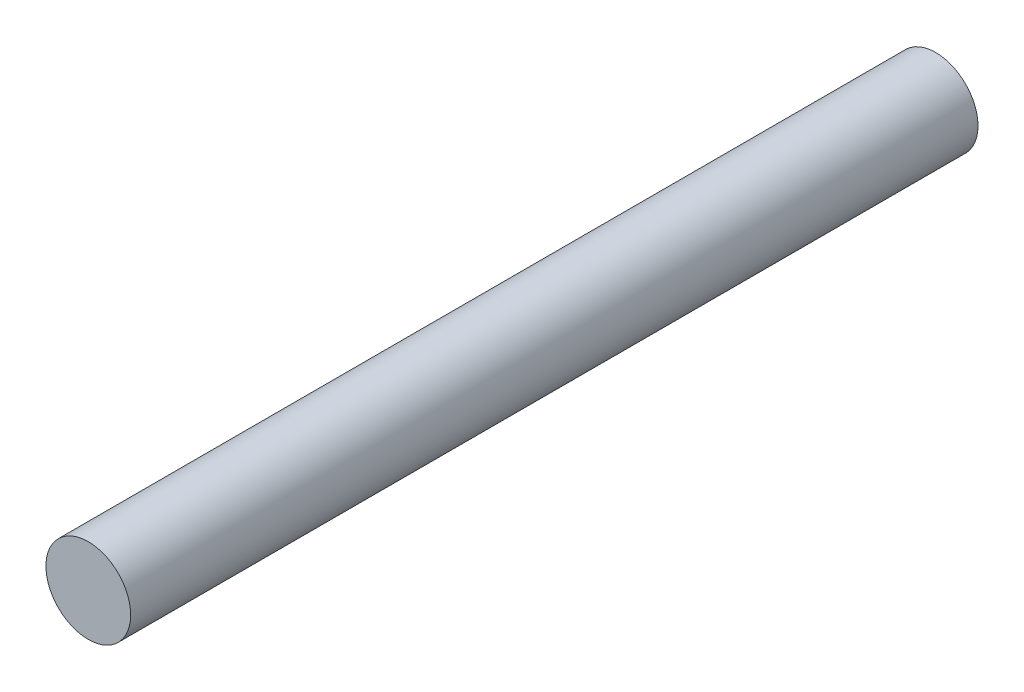
ISO-10303-21;
HEADER;
FILE_DESCRIPTION(('STEP AP214'),'2;1');
FILE_NAME('part.step','',(''),(''),'','','');
FILE_SCHEMA(('AUTOMOTIVE_DESIGN { 1 0 10303 214 1 1 1 1 }'));
ENDSEC;
DATA;
#1=APPLICATION_CONTEXT('core data for automotive mechanical design processes');
#2=APPLICATION_PROTOCOL_DEFINITION('international standard','automotive_design',2000,#1);
#3=PRODUCT_CONTEXT('',#1,'mechanical');
#4=PRODUCT('Part','Part','',(#3));
#5=PRODUCT_RELATED_PRODUCT_CATEGORY('part','',(#4));
#6=PRODUCT_DEFINITION_FORMATION('','',#4);
#7=PRODUCT_DEFINITION_CONTEXT('part definition',#1,'design');
#8=PRODUCT_DEFINITION('design','',#6,#7);
#9=PRODUCT_DEFINITION_SHAPE('','',#8);
#10=(LENGTH_UNIT() NAMED_UNIT(*) SI_UNIT(.MILLI.,.METRE.));
#11=(NAMED_UNIT(*) PLANE_ANGLE_UNIT() SI_UNIT($,.RADIAN.));
#12=(NAMED_UNIT(*) SI_UNIT($,.STERADIAN.) SOLID_ANGLE_UNIT());
#13=UNCERTAINTY_MEASURE_WITH_UNIT(LENGTH_MEASURE(1.E-05),#10,'distance_accuracy_value','');
#14=(GEOMETRIC_REPRESENTATION_CONTEXT(3) GLOBAL_UNCERTAINTY_ASSIGNED_CONTEXT((#13)) GLOBAL_UNIT_ASSIGNED_CONTEXT((#10,
#11,#12)) REPRESENTATION_CONTEXT('',''));
#15=CARTESIAN_POINT('',(0.,0.,0.));
#16=DIRECTION('',(0.,0.,1.));
#17=DIRECTION('',(1.,0.,0.));
#18=AXIS2_PLACEMENT_3D('',#15,#16,#17);
#19=CARTESIAN_POINT('',(0.,0.,30.));
#20=DIRECTION('',(0.,0.,-1.));
#21=DIRECTION('',(-1.,0.,0.));
#22=AXIS2_PLACEMENT_3D('',#19,#20,#21);
#23=CYLINDRICAL_SURFACE('',#22,1.5);
#24=CARTESIAN_POINT('',(0.,0.,30.));
#25=DIRECTION('',(0.,0.,1.));
#26=DIRECTION('',(1.,0.,0.));
#27=AXIS2_PLACEMENT_3D('',#24,#25,#26);
#28=CIRCLE('',#27,1.5);
#29=CARTESIAN_POINT('',(1.5,0.,30.));
#30=VERTEX_POINT('',#29);
#31=EDGE_CURVE('E10',#30,#30,#28,.T.);
#32=ORIENTED_EDGE('',*,*,#31,.F.);
#33=EDGE_LOOP('',(#32));
#34=FACE_BOUND('',#33,.T.);
#35=CARTESIAN_POINT('',(0.,0.,0.));
#36=DIRECTION('',(0.,0.,1.));
#37=DIRECTION('',(1.,0.,0.));
#38=AXIS2_PLACEMENT_3D('',#35,#36,#37);
#39=CIRCLE('',#38,1.5);
#40=CARTESIAN_POINT('',(1.5,0.,0.));
#41=VERTEX_POINT('',#40);
#42=EDGE_CURVE('E32',#41,#41,#39,.T.);
#43=ORIENTED_EDGE('',*,*,#42,.T.);
#44=EDGE_LOOP('',(#43));
#45=FACE_BOUND('',#44,.T.);
#46=ADVANCED_FACE('F29',(#34,#45),#23,.T.);
#47=CARTESIAN_POINT('',(0.,0.,30.));
#48=DIRECTION('',(0.,0.,1.));
#49=DIRECTION('',(1.,0.,0.));
#50=AXIS2_PLACEMENT_3D('',#47,#48,#49);
#51=PLANE('',#50);
#52=ORIENTED_EDGE('',*,*,#31,.T.);
#53=EDGE_LOOP('',(#52));
#54=FACE_BOUND('',#53,.T.);
#55=ADVANCED_FACE('F44',(#54),#51,.T.);
#56=CARTESIAN_POINT('',(0.,0.,0.));
#57=DIRECTION('',(0.,0.,1.));
#58=DIRECTION('',(1.,0.,0.));
#59=AXIS2_PLACEMENT_3D('',#56,#57,#58);
#60=PLANE('',#59);
#61=ORIENTED_EDGE('',*,*,#42,.F.);
#62=EDGE_LOOP('',(#61));
#63=FACE_BOUND('',#62,.T.);
#64=ADVANCED_FACE('F42',(#63),#60,.F.);
#65=CLOSED_SHELL('',(#46,#55,#64));
#66=MANIFOLD_SOLID_BREP('B2',#65);
#67=ADVANCED_BREP_SHAPE_REPRESENTATION('',(#18,#66),#14);
#68=SHAPE_DEFINITION_REPRESENTATION(#9,#67);
ENDSEC;
END-ISO-10303-21;
